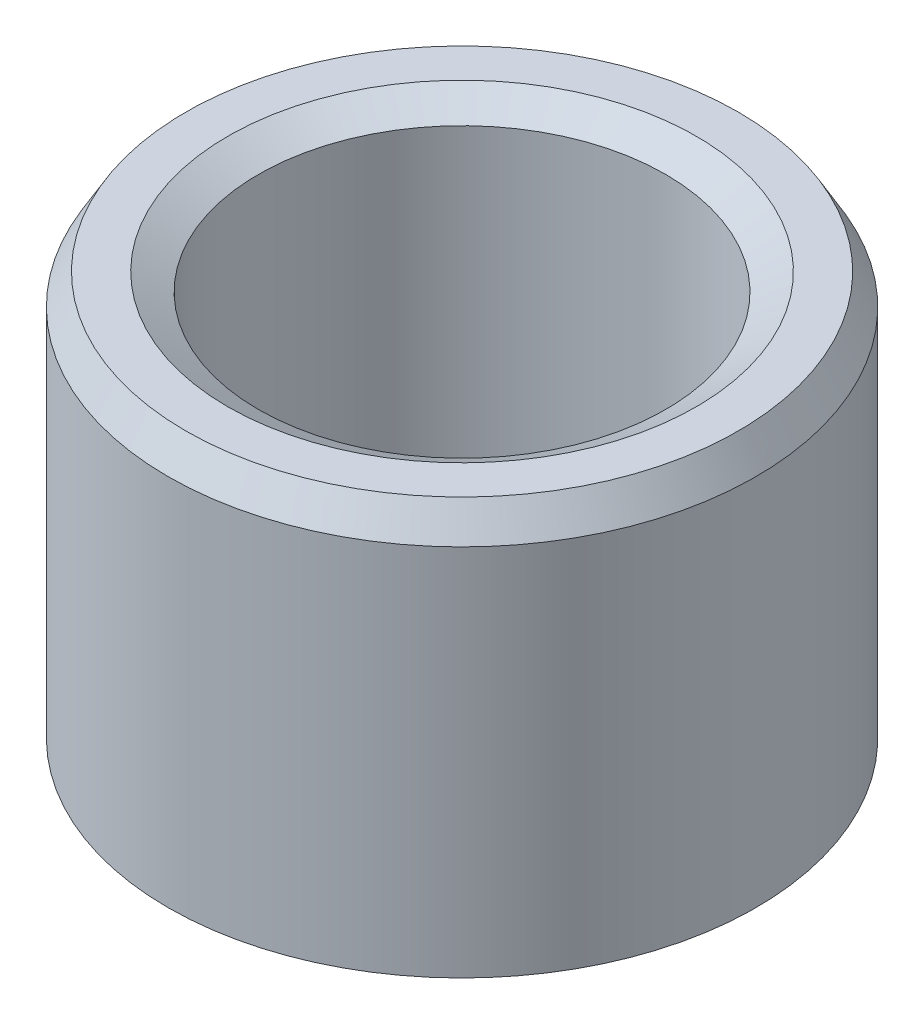
ISO-10303-21;
HEADER;
FILE_DESCRIPTION(('STEP AP214'),'2;1');
FILE_NAME('part.step','',(''),(''),'','','');
FILE_SCHEMA(('AUTOMOTIVE_DESIGN { 1 0 10303 214 1 1 1 1 }'));
ENDSEC;
DATA;
#1=APPLICATION_CONTEXT('core data for automotive mechanical design processes');
#2=APPLICATION_PROTOCOL_DEFINITION('international standard','automotive_design',2000,#1);
#3=PRODUCT_CONTEXT('',#1,'mechanical');
#4=PRODUCT('Part','Part','',(#3));
#5=PRODUCT_RELATED_PRODUCT_CATEGORY('part','',(#4));
#6=PRODUCT_DEFINITION_FORMATION('','',#4);
#7=PRODUCT_DEFINITION_CONTEXT('part definition',#1,'design');
#8=PRODUCT_DEFINITION('design','',#6,#7);
#9=PRODUCT_DEFINITION_SHAPE('','',#8);
#10=(LENGTH_UNIT() NAMED_UNIT(*) SI_UNIT(.MILLI.,.METRE.));
#11=(NAMED_UNIT(*) PLANE_ANGLE_UNIT() SI_UNIT($,.RADIAN.));
#12=(NAMED_UNIT(*) SI_UNIT($,.STERADIAN.) SOLID_ANGLE_UNIT());
#13=UNCERTAINTY_MEASURE_WITH_UNIT(LENGTH_MEASURE(1.E-05),#10,'distance_accuracy_value','');
#14=(GEOMETRIC_REPRESENTATION_CONTEXT(3) GLOBAL_UNCERTAINTY_ASSIGNED_CONTEXT((#13)) GLOBAL_UNIT_ASSIGNED_CONTEXT((#10,
#11,#12)) REPRESENTATION_CONTEXT('',''));
#15=CARTESIAN_POINT('',(0.,0.,0.));
#16=DIRECTION('',(0.,0.,1.));
#17=DIRECTION('',(1.,0.,0.));
#18=AXIS2_PLACEMENT_3D('',#15,#16,#17);
#19=CARTESIAN_POINT('',(0.,50.2143359192486,0.));
#20=DIRECTION('',(0.,-1.,0.));
#21=DIRECTION('',(0.,0.,-1.));
#22=AXIS2_PLACEMENT_3D('',#19,#20,#21);
#23=CYLINDRICAL_SURFACE('',#22,35.);
#24=CARTESIAN_POINT('',(0.,2.10890840670918,0.));
#25=DIRECTION('',(0.,1.,0.));
#26=DIRECTION('',(0.,0.,1.));
#27=AXIS2_PLACEMENT_3D('',#24,#25,#26);
#28=CIRCLE('',#27,35.);
#29=CARTESIAN_POINT('',(0.,2.10890840670918,35.));
#30=VERTEX_POINT('',#29);
#31=EDGE_CURVE('E10',#30,#30,#28,.T.);
#32=ORIENTED_EDGE('',*,*,#31,.T.);
#33=EDGE_LOOP('',(#32));
#34=FACE_BOUND('',#33,.T.);
#35=CARTESIAN_POINT('',(0.,46.5615994103191,0.));
#36=DIRECTION('',(0.,1.,0.));
#37=DIRECTION('',(0.,0.,1.));
#38=AXIS2_PLACEMENT_3D('',#35,#36,#37);
#39=CIRCLE('',#38,35.);
#40=CARTESIAN_POINT('',(0.,46.5615994103191,35.));
#41=VERTEX_POINT('',#40);
#42=EDGE_CURVE('E50',#41,#41,#39,.F.);
#43=ORIENTED_EDGE('',*,*,#42,.T.);
#44=EDGE_LOOP('',(#43));
#45=FACE_BOUND('',#44,.T.);
#46=ADVANCED_FACE('F39',(#34,#45),#23,.T.);
#47=CARTESIAN_POINT('',(0.,50.2143359192486,0.));
#48=DIRECTION('',(0.,1.,0.));
#49=DIRECTION('',(0.,0.,1.));
#50=AXIS2_PLACEMENT_3D('',#47,#48,#49);
#51=PLANE('',#50);
#52=CARTESIAN_POINT('',(0.,50.2143359192486,0.));
#53=DIRECTION('',(0.,1.,0.));
#54=DIRECTION('',(0.,0.,1.));
#55=AXIS2_PLACEMENT_3D('',#52,#53,#54);
#56=CIRCLE('',#55,27.8998517648834);
#57=CARTESIAN_POINT('',(0.,50.2143359192486,27.8998517648834));
#58=VERTEX_POINT('',#57);
#59=EDGE_CURVE('E58',#58,#58,#56,.F.);
#60=ORIENTED_EDGE('',*,*,#59,.T.);
#61=EDGE_LOOP('',(#60));
#62=FACE_BOUND('',#61,.T.);
#63=CARTESIAN_POINT('',(0.,50.2143359192486,0.));
#64=DIRECTION('',(0.,1.,0.));
#65=DIRECTION('',(0.,0.,1.));
#66=AXIS2_PLACEMENT_3D('',#63,#64,#65);
#67=CIRCLE('',#66,32.8910915932908);
#68=CARTESIAN_POINT('',(0.,50.2143359192486,32.8910915932908));
#69=VERTEX_POINT('',#68);
#70=EDGE_CURVE('E61',#69,#69,#67,.T.);
#71=ORIENTED_EDGE('',*,*,#70,.T.);
#72=EDGE_LOOP('',(#71));
#73=FACE_BOUND('',#72,.T.);
#74=ADVANCED_FACE('F88',(#62,#73),#51,.T.);
#75=CARTESIAN_POINT('',(0.,0.,0.));
#76=DIRECTION('',(0.,1.,0.));
#77=DIRECTION('',(0.,0.,1.));
#78=AXIS2_PLACEMENT_3D('',#75,#76,#77);
#79=PLANE('',#78);
#80=CARTESIAN_POINT('',(0.,0.,0.));
#81=DIRECTION('',(0.,1.,0.));
#82=DIRECTION('',(0.,0.,1.));
#83=AXIS2_PLACEMENT_3D('',#80,#81,#82);
#84=CIRCLE('',#83,26.3560236626632);
#85=CARTESIAN_POINT('',(0.,0.,26.3560236626632));
#86=VERTEX_POINT('',#85);
#87=EDGE_CURVE('E51',#86,#86,#84,.T.);
#88=ORIENTED_EDGE('',*,*,#87,.T.);
#89=EDGE_LOOP('',(#88));
#90=FACE_BOUND('',#89,.T.);
#91=CARTESIAN_POINT('',(0.,0.,0.));
#92=DIRECTION('',(0.,1.,0.));
#93=DIRECTION('',(0.,0.,1.));
#94=AXIS2_PLACEMENT_3D('',#91,#92,#93);
#95=CIRCLE('',#94,31.3472634910705);
#96=CARTESIAN_POINT('',(0.,0.,31.3472634910705));
#97=VERTEX_POINT('',#96);
#98=EDGE_CURVE('E54',#97,#97,#95,.F.);
#99=ORIENTED_EDGE('',*,*,#98,.T.);
#100=EDGE_LOOP('',(#99));
#101=FACE_BOUND('',#100,.T.);
#102=ADVANCED_FACE('F83',(#90,#101),#79,.F.);
#103=CARTESIAN_POINT('',(0.,50.2143359192486,0.));
#104=DIRECTION('',(0.,-1.,0.));
#105=DIRECTION('',(0.,0.,-1.));
#106=AXIS2_PLACEMENT_3D('',#103,#104,#105);
#107=CYLINDRICAL_SURFACE('',#106,24.247115255954);
#108=CARTESIAN_POINT('',(0.,48.1054275125394,0.));
#109=DIRECTION('',(0.,1.,0.));
#110=DIRECTION('',(0.,0.,1.));
#111=AXIS2_PLACEMENT_3D('',#108,#109,#110);
#112=CIRCLE('',#111,24.247115255954);
#113=CARTESIAN_POINT('',(0.,48.1054275125394,24.247115255954));
#114=VERTEX_POINT('',#113);
#115=EDGE_CURVE('E67',#114,#114,#112,.T.);
#116=ORIENTED_EDGE('',*,*,#115,.T.);
#117=EDGE_LOOP('',(#116));
#118=FACE_BOUND('',#117,.T.);
#119=CARTESIAN_POINT('',(0.,3.65273650892947,0.));
#120=DIRECTION('',(0.,1.,0.));
#121=DIRECTION('',(0.,0.,1.));
#122=AXIS2_PLACEMENT_3D('',#119,#120,#121);
#123=CIRCLE('',#122,24.247115255954);
#124=CARTESIAN_POINT('',(0.,3.65273650892947,24.247115255954));
#125=VERTEX_POINT('',#124);
#126=EDGE_CURVE('E69',#125,#125,#123,.F.);
#127=ORIENTED_EDGE('',*,*,#126,.T.);
#128=EDGE_LOOP('',(#127));
#129=FACE_BOUND('',#128,.T.);
#130=ADVANCED_FACE('F71',(#118,#129),#107,.F.);
#131=CARTESIAN_POINT('',(0.,48.1054275125394,0.));
#132=DIRECTION('',(0.,1.,0.));
#133=DIRECTION('',(0.,0.,1.));
#134=AXIS2_PLACEMENT_3D('',#131,#132,#133);
#135=CONICAL_SURFACE('',#134,24.247115255954,1.0471975511966);
#136=ORIENTED_EDGE('',*,*,#59,.F.);
#137=EDGE_LOOP('',(#136));
#138=FACE_BOUND('',#137,.T.);
#139=ORIENTED_EDGE('',*,*,#115,.F.);
#140=EDGE_LOOP('',(#139));
#141=FACE_BOUND('',#140,.T.);
#142=ADVANCED_FACE('F77',(#138,#141),#135,.F.);
#143=CARTESIAN_POINT('',(0.,0.,0.));
#144=DIRECTION('',(0.,-1.,0.));
#145=DIRECTION('',(0.,0.,-1.));
#146=AXIS2_PLACEMENT_3D('',#143,#144,#145);
#147=CONICAL_SURFACE('',#146,26.3560236626632,0.523598775598297);
#148=ORIENTED_EDGE('',*,*,#126,.F.);
#149=EDGE_LOOP('',(#148));
#150=FACE_BOUND('',#149,.T.);
#151=ORIENTED_EDGE('',*,*,#87,.F.);
#152=EDGE_LOOP('',(#151));
#153=FACE_BOUND('',#152,.T.);
#154=ADVANCED_FACE('F73',(#150,#153),#147,.F.);
#155=CARTESIAN_POINT('',(0.,2.10890840670918,0.));
#156=DIRECTION('',(0.,1.,0.));
#157=DIRECTION('',(0.,0.,1.));
#158=AXIS2_PLACEMENT_3D('',#155,#156,#157);
#159=CONICAL_SURFACE('',#158,35.,1.0471975511966);
#160=ORIENTED_EDGE('',*,*,#98,.F.);
#161=EDGE_LOOP('',(#160));
#162=FACE_BOUND('',#161,.T.);
#163=ORIENTED_EDGE('',*,*,#31,.F.);
#164=EDGE_LOOP('',(#163));
#165=FACE_BOUND('',#164,.T.);
#166=ADVANCED_FACE('F76',(#162,#165),#159,.T.);
#167=CARTESIAN_POINT('',(0.,50.2143359192486,0.));
#168=DIRECTION('',(0.,-1.,0.));
#169=DIRECTION('',(0.,0.,-1.));
#170=AXIS2_PLACEMENT_3D('',#167,#168,#169);
#171=CONICAL_SURFACE('',#170,32.8910915932908,0.523598775598295);
#172=ORIENTED_EDGE('',*,*,#42,.F.);
#173=EDGE_LOOP('',(#172));
#174=FACE_BOUND('',#173,.T.);
#175=ORIENTED_EDGE('',*,*,#70,.F.);
#176=EDGE_LOOP('',(#175));
#177=FACE_BOUND('',#176,.T.);
#178=ADVANCED_FACE('F45',(#174,#177),#171,.T.);
#179=CLOSED_SHELL('',(#46,#74,#102,#130,#142,#154,#166,#178));
#180=MANIFOLD_SOLID_BREP('B2',#179);
#181=ADVANCED_BREP_SHAPE_REPRESENTATION('',(#18,#180),#14);
#182=SHAPE_DEFINITION_REPRESENTATION(#9,#181);
ENDSEC;
END-ISO-10303-21;
